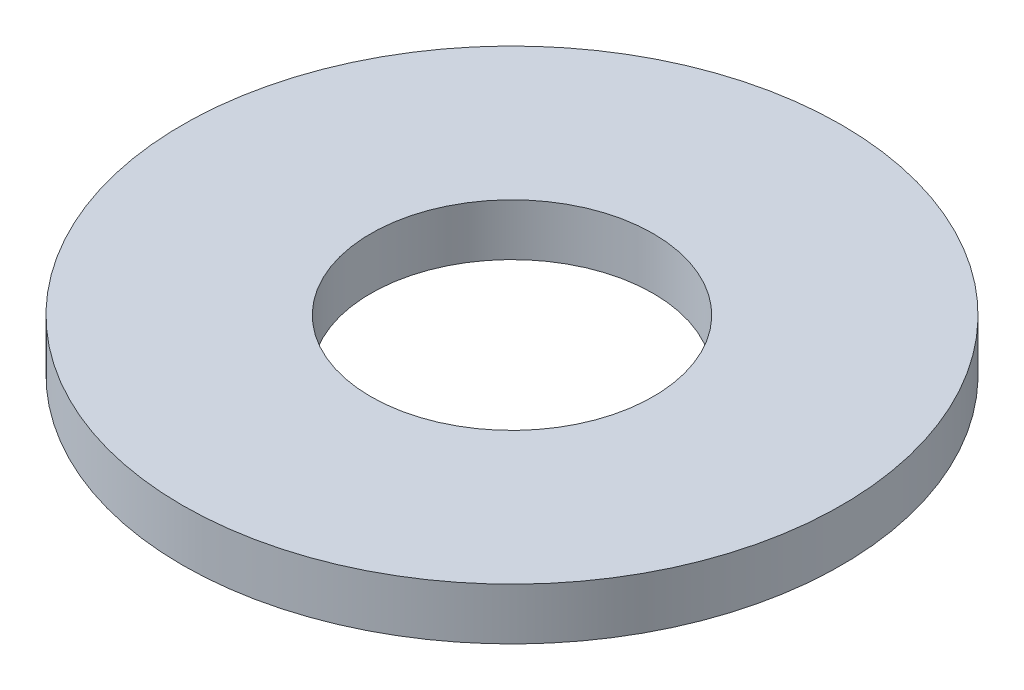
ISO-10303-21;
HEADER;
FILE_DESCRIPTION(('STEP AP214'),'2;1');
FILE_NAME('part.step','',(''),(''),'','','');
FILE_SCHEMA(('AUTOMOTIVE_DESIGN { 1 0 10303 214 1 1 1 1 }'));
ENDSEC;
DATA;
#1=APPLICATION_CONTEXT('core data for automotive mechanical design processes');
#2=APPLICATION_PROTOCOL_DEFINITION('international standard','automotive_design',2000,#1);
#3=PRODUCT_CONTEXT('',#1,'mechanical');
#4=PRODUCT('Part','Part','',(#3));
#5=PRODUCT_RELATED_PRODUCT_CATEGORY('part','',(#4));
#6=PRODUCT_DEFINITION_FORMATION('','',#4);
#7=PRODUCT_DEFINITION_CONTEXT('part definition',#1,'design');
#8=PRODUCT_DEFINITION('design','',#6,#7);
#9=PRODUCT_DEFINITION_SHAPE('','',#8);
#10=(LENGTH_UNIT() NAMED_UNIT(*) SI_UNIT(.MILLI.,.METRE.));
#11=(NAMED_UNIT(*) PLANE_ANGLE_UNIT() SI_UNIT($,.RADIAN.));
#12=(NAMED_UNIT(*) SI_UNIT($,.STERADIAN.) SOLID_ANGLE_UNIT());
#13=UNCERTAINTY_MEASURE_WITH_UNIT(LENGTH_MEASURE(1.E-05),#10,'distance_accuracy_value','');
#14=(GEOMETRIC_REPRESENTATION_CONTEXT(3) GLOBAL_UNCERTAINTY_ASSIGNED_CONTEXT((#13)) GLOBAL_UNIT_ASSIGNED_CONTEXT((#10,
#11,#12)) REPRESENTATION_CONTEXT('',''));
#15=CARTESIAN_POINT('',(0.,0.,0.));
#16=DIRECTION('',(0.,0.,1.));
#17=DIRECTION('',(1.,0.,0.));
#18=AXIS2_PLACEMENT_3D('',#15,#16,#17);
#19=CARTESIAN_POINT('',(0.,11.,0.));
#20=DIRECTION('',(0.,-1.,0.));
#21=DIRECTION('',(0.,0.,-1.));
#22=AXIS2_PLACEMENT_3D('',#19,#20,#21);
#23=CYLINDRICAL_SURFACE('',#22,70.);
#24=CARTESIAN_POINT('',(0.,11.,0.));
#25=DIRECTION('',(0.,1.,0.));
#26=DIRECTION('',(0.,0.,1.));
#27=AXIS2_PLACEMENT_3D('',#24,#25,#26);
#28=CIRCLE('',#27,70.);
#29=CARTESIAN_POINT('',(0.,11.,70.));
#30=VERTEX_POINT('',#29);
#31=EDGE_CURVE('E10',#30,#30,#28,.T.);
#32=ORIENTED_EDGE('',*,*,#31,.F.);
#33=EDGE_LOOP('',(#32));
#34=FACE_BOUND('',#33,.T.);
#35=CARTESIAN_POINT('',(0.,0.,0.));
#36=DIRECTION('',(0.,1.,0.));
#37=DIRECTION('',(0.,0.,1.));
#38=AXIS2_PLACEMENT_3D('',#35,#36,#37);
#39=CIRCLE('',#38,70.);
#40=CARTESIAN_POINT('',(0.,0.,70.));
#41=VERTEX_POINT('',#40);
#42=EDGE_CURVE('E37',#41,#41,#39,.T.);
#43=ORIENTED_EDGE('',*,*,#42,.T.);
#44=EDGE_LOOP('',(#43));
#45=FACE_BOUND('',#44,.T.);
#46=ADVANCED_FACE('F40',(#34,#45),#23,.T.);
#47=CARTESIAN_POINT('',(0.,11.,0.));
#48=DIRECTION('',(0.,1.,0.));
#49=DIRECTION('',(0.,0.,1.));
#50=AXIS2_PLACEMENT_3D('',#47,#48,#49);
#51=PLANE('',#50);
#52=CARTESIAN_POINT('',(0.,11.,0.));
#53=DIRECTION('',(0.,1.,0.));
#54=DIRECTION('',(0.,0.,1.));
#55=AXIS2_PLACEMENT_3D('',#52,#53,#54);
#56=CIRCLE('',#55,30.);
#57=CARTESIAN_POINT('',(0.,11.,30.));
#58=VERTEX_POINT('',#57);
#59=EDGE_CURVE('E50',#58,#58,#56,.T.);
#60=ORIENTED_EDGE('',*,*,#59,.F.);
#61=EDGE_LOOP('',(#60));
#62=FACE_BOUND('',#61,.T.);
#63=ORIENTED_EDGE('',*,*,#31,.T.);
#64=EDGE_LOOP('',(#63));
#65=FACE_BOUND('',#64,.T.);
#66=ADVANCED_FACE('F59',(#62,#65),#51,.T.);
#67=CARTESIAN_POINT('',(0.,0.,0.));
#68=DIRECTION('',(0.,1.,0.));
#69=DIRECTION('',(0.,0.,1.));
#70=AXIS2_PLACEMENT_3D('',#67,#68,#69);
#71=PLANE('',#70);
#72=CARTESIAN_POINT('',(0.,0.,0.));
#73=DIRECTION('',(0.,1.,0.));
#74=DIRECTION('',(0.,0.,1.));
#75=AXIS2_PLACEMENT_3D('',#72,#73,#74);
#76=CIRCLE('',#75,30.);
#77=CARTESIAN_POINT('',(0.,0.,30.));
#78=VERTEX_POINT('',#77);
#79=EDGE_CURVE('E47',#78,#78,#76,.T.);
#80=ORIENTED_EDGE('',*,*,#79,.T.);
#81=EDGE_LOOP('',(#80));
#82=FACE_BOUND('',#81,.T.);
#83=ORIENTED_EDGE('',*,*,#42,.F.);
#84=EDGE_LOOP('',(#83));
#85=FACE_BOUND('',#84,.T.);
#86=ADVANCED_FACE('F58',(#82,#85),#71,.F.);
#87=CARTESIAN_POINT('',(0.,11.,0.));
#88=DIRECTION('',(0.,-1.,0.));
#89=DIRECTION('',(0.,0.,-1.));
#90=AXIS2_PLACEMENT_3D('',#87,#88,#89);
#91=CYLINDRICAL_SURFACE('',#90,30.);
#92=ORIENTED_EDGE('',*,*,#59,.T.);
#93=EDGE_LOOP('',(#92));
#94=FACE_BOUND('',#93,.T.);
#95=ORIENTED_EDGE('',*,*,#79,.F.);
#96=EDGE_LOOP('',(#95));
#97=FACE_BOUND('',#96,.T.);
#98=ADVANCED_FACE('F54',(#94,#97),#91,.F.);
#99=CLOSED_SHELL('',(#46,#66,#86,#98));
#100=MANIFOLD_SOLID_BREP('B2',#99);
#101=ADVANCED_BREP_SHAPE_REPRESENTATION('',(#18,#100),#14);
#102=SHAPE_DEFINITION_REPRESENTATION(#9,#101);
ENDSEC;
END-ISO-10303-21;
